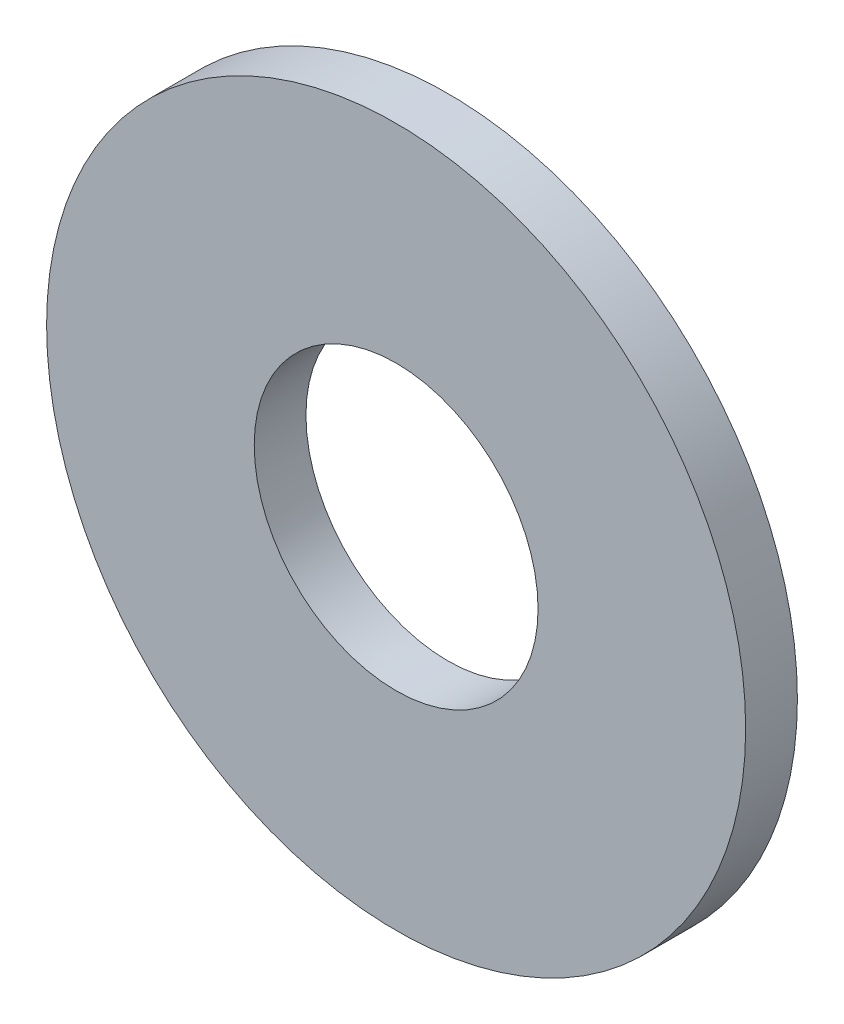
ISO-10303-21;
HEADER;
FILE_DESCRIPTION(('STEP AP214'),'2;1');
FILE_NAME('part.step','',(''),(''),'','','');
FILE_SCHEMA(('AUTOMOTIVE_DESIGN { 1 0 10303 214 1 1 1 1 }'));
ENDSEC;
DATA;
#1=APPLICATION_CONTEXT('core data for automotive mechanical design processes');
#2=APPLICATION_PROTOCOL_DEFINITION('international standard','automotive_design',2000,#1);
#3=PRODUCT_CONTEXT('',#1,'mechanical');
#4=PRODUCT('Part','Part','',(#3));
#5=PRODUCT_RELATED_PRODUCT_CATEGORY('part','',(#4));
#6=PRODUCT_DEFINITION_FORMATION('','',#4);
#7=PRODUCT_DEFINITION_CONTEXT('part definition',#1,'design');
#8=PRODUCT_DEFINITION('design','',#6,#7);
#9=PRODUCT_DEFINITION_SHAPE('','',#8);
#10=(LENGTH_UNIT() NAMED_UNIT(*) SI_UNIT(.MILLI.,.METRE.));
#11=(NAMED_UNIT(*) PLANE_ANGLE_UNIT() SI_UNIT($,.RADIAN.));
#12=(NAMED_UNIT(*) SI_UNIT($,.STERADIAN.) SOLID_ANGLE_UNIT());
#13=UNCERTAINTY_MEASURE_WITH_UNIT(LENGTH_MEASURE(1.E-05),#10,'distance_accuracy_value','');
#14=(GEOMETRIC_REPRESENTATION_CONTEXT(3) GLOBAL_UNCERTAINTY_ASSIGNED_CONTEXT((#13)) GLOBAL_UNIT_ASSIGNED_CONTEXT((#10,
#11,#12)) REPRESENTATION_CONTEXT('',''));
#15=CARTESIAN_POINT('',(0.,0.,0.));
#16=DIRECTION('',(0.,0.,1.));
#17=DIRECTION('',(1.,0.,0.));
#18=AXIS2_PLACEMENT_3D('',#15,#16,#17);
#19=CARTESIAN_POINT('',(0.,0.,34.925));
#20=DIRECTION('',(0.,0.,1.));
#21=DIRECTION('',(1.,0.,0.));
#22=AXIS2_PLACEMENT_3D('',#19,#20,#21);
#23=CYLINDRICAL_SURFACE('',#22,10.3124);
#24=CARTESIAN_POINT('',(0.,0.,0.));
#25=DIRECTION('',(0.,0.,1.));
#26=DIRECTION('',(1.,0.,0.));
#27=AXIS2_PLACEMENT_3D('',#24,#25,#26);
#28=CIRCLE('',#27,10.3124);
#29=CARTESIAN_POINT('',(10.3124,0.,0.));
#30=VERTEX_POINT('',#29);
#31=EDGE_CURVE('E10',#30,#30,#28,.T.);
#32=ORIENTED_EDGE('',*,*,#31,.F.);
#33=EDGE_LOOP('',(#32));
#34=FACE_BOUND('',#33,.T.);
#35=CARTESIAN_POINT('',(0.,0.,3.7592));
#36=DIRECTION('',(0.,0.,1.));
#37=DIRECTION('',(1.,0.,0.));
#38=AXIS2_PLACEMENT_3D('',#35,#36,#37);
#39=CIRCLE('',#38,10.3124);
#40=CARTESIAN_POINT('',(10.3124,0.,3.7592));
#41=VERTEX_POINT('',#40);
#42=EDGE_CURVE('E29',#41,#41,#39,.T.);
#43=ORIENTED_EDGE('',*,*,#42,.T.);
#44=EDGE_LOOP('',(#43));
#45=FACE_BOUND('',#44,.T.);
#46=ADVANCED_FACE('F15',(#34,#45),#23,.F.);
#47=CARTESIAN_POINT('',(0.,10.3124,0.));
#48=DIRECTION('',(0.,0.,1.));
#49=DIRECTION('',(1.,0.,0.));
#50=AXIS2_PLACEMENT_3D('',#47,#48,#49);
#51=PLANE('',#50);
#52=CARTESIAN_POINT('',(0.,0.,0.));
#53=DIRECTION('',(0.,0.,1.));
#54=DIRECTION('',(1.,0.,0.));
#55=AXIS2_PLACEMENT_3D('',#52,#53,#54);
#56=CIRCLE('',#55,25.4);
#57=CARTESIAN_POINT('',(25.4,0.,0.));
#58=VERTEX_POINT('',#57);
#59=EDGE_CURVE('E21',#58,#58,#56,.T.);
#60=ORIENTED_EDGE('',*,*,#59,.F.);
#61=EDGE_LOOP('',(#60));
#62=FACE_BOUND('',#61,.T.);
#63=ORIENTED_EDGE('',*,*,#31,.T.);
#64=EDGE_LOOP('',(#63));
#65=FACE_BOUND('',#64,.T.);
#66=ADVANCED_FACE('F44',(#62,#65),#51,.F.);
#67=CARTESIAN_POINT('',(0.,0.,34.925));
#68=DIRECTION('',(0.,0.,1.));
#69=DIRECTION('',(1.,0.,0.));
#70=AXIS2_PLACEMENT_3D('',#67,#68,#69);
#71=CYLINDRICAL_SURFACE('',#70,25.4);
#72=CARTESIAN_POINT('',(0.,0.,3.7592));
#73=DIRECTION('',(0.,0.,1.));
#74=DIRECTION('',(1.,0.,0.));
#75=AXIS2_PLACEMENT_3D('',#72,#73,#74);
#76=CIRCLE('',#75,25.4);
#77=CARTESIAN_POINT('',(25.4,0.,3.7592));
#78=VERTEX_POINT('',#77);
#79=EDGE_CURVE('E25',#78,#78,#76,.T.);
#80=ORIENTED_EDGE('',*,*,#79,.F.);
#81=EDGE_LOOP('',(#80));
#82=FACE_BOUND('',#81,.T.);
#83=ORIENTED_EDGE('',*,*,#59,.T.);
#84=EDGE_LOOP('',(#83));
#85=FACE_BOUND('',#84,.T.);
#86=ADVANCED_FACE('F39',(#82,#85),#71,.T.);
#87=CARTESIAN_POINT('',(0.,25.4,3.7592));
#88=DIRECTION('',(0.,0.,-1.));
#89=DIRECTION('',(-1.,0.,0.));
#90=AXIS2_PLACEMENT_3D('',#87,#88,#89);
#91=PLANE('',#90);
#92=ORIENTED_EDGE('',*,*,#42,.F.);
#93=EDGE_LOOP('',(#92));
#94=FACE_BOUND('',#93,.T.);
#95=ORIENTED_EDGE('',*,*,#79,.T.);
#96=EDGE_LOOP('',(#95));
#97=FACE_BOUND('',#96,.T.);
#98=ADVANCED_FACE('F36',(#94,#97),#91,.F.);
#99=CLOSED_SHELL('',(#46,#66,#86,#98));
#100=MANIFOLD_SOLID_BREP('B1',#99);
#101=ADVANCED_BREP_SHAPE_REPRESENTATION('',(#18,#100),#14);
#102=SHAPE_DEFINITION_REPRESENTATION(#9,#101);
ENDSEC;
END-ISO-10303-21;
